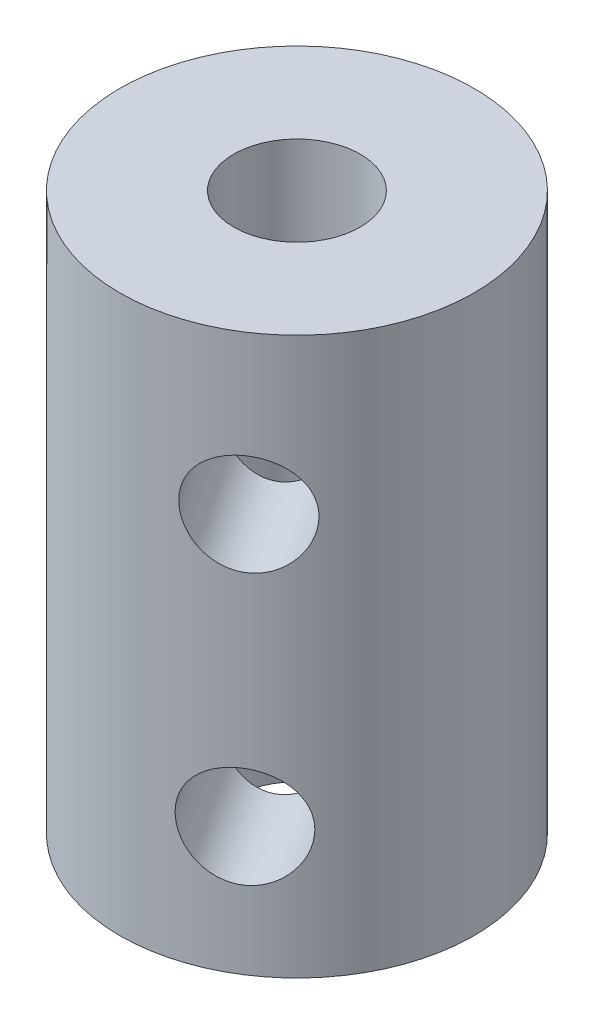
ISO-10303-21;
HEADER;
FILE_DESCRIPTION(('STEP AP214'),'2;1');
FILE_NAME('part.step','',(''),(''),'','','');
FILE_SCHEMA(('AUTOMOTIVE_DESIGN { 1 0 10303 214 1 1 1 1 }'));
ENDSEC;
DATA;
#1=APPLICATION_CONTEXT('core data for automotive mechanical design processes');
#2=APPLICATION_PROTOCOL_DEFINITION('international standard','automotive_design',2000,#1);
#3=PRODUCT_CONTEXT('',#1,'mechanical');
#4=PRODUCT('Part','Part','',(#3));
#5=PRODUCT_RELATED_PRODUCT_CATEGORY('part','',(#4));
#6=PRODUCT_DEFINITION_FORMATION('','',#4);
#7=PRODUCT_DEFINITION_CONTEXT('part definition',#1,'design');
#8=PRODUCT_DEFINITION('design','',#6,#7);
#9=PRODUCT_DEFINITION_SHAPE('','',#8);
#10=(LENGTH_UNIT() NAMED_UNIT(*) SI_UNIT(.MILLI.,.METRE.));
#11=(NAMED_UNIT(*) PLANE_ANGLE_UNIT() SI_UNIT($,.RADIAN.));
#12=(NAMED_UNIT(*) SI_UNIT($,.STERADIAN.) SOLID_ANGLE_UNIT());
#13=UNCERTAINTY_MEASURE_WITH_UNIT(LENGTH_MEASURE(1.E-05),#10,'distance_accuracy_value','');
#14=(GEOMETRIC_REPRESENTATION_CONTEXT(3) GLOBAL_UNCERTAINTY_ASSIGNED_CONTEXT((#13)) GLOBAL_UNIT_ASSIGNED_CONTEXT((#10,
#11,#12)) REPRESENTATION_CONTEXT('',''));
#15=CARTESIAN_POINT('',(0.,0.,0.));
#16=DIRECTION('',(0.,0.,1.));
#17=DIRECTION('',(1.,0.,0.));
#18=AXIS2_PLACEMENT_3D('',#15,#16,#17);
#19=CARTESIAN_POINT('',(0.,22.,0.));
#20=DIRECTION('',(0.,1.,0.));
#21=DIRECTION('',(0.,0.,1.));
#22=AXIS2_PLACEMENT_3D('',#19,#20,#21);
#23=PLANE('',#22);
#24=CARTESIAN_POINT('',(0.,22.,0.));
#25=DIRECTION('',(0.,1.,0.));
#26=DIRECTION('',(0.,0.,1.));
#27=AXIS2_PLACEMENT_3D('',#24,#25,#26);
#28=CIRCLE('',#27,7.);
#29=CARTESIAN_POINT('',(0.,22.,7.));
#30=VERTEX_POINT('',#29);
#31=EDGE_CURVE('E10',#30,#30,#28,.T.);
#32=ORIENTED_EDGE('',*,*,#31,.T.);
#33=EDGE_LOOP('',(#32));
#34=FACE_BOUND('',#33,.T.);
#35=CARTESIAN_POINT('',(0.,22.,0.));
#36=DIRECTION('',(0.,1.,0.));
#37=DIRECTION('',(0.,0.,1.));
#38=AXIS2_PLACEMENT_3D('',#35,#36,#37);
#39=CIRCLE('',#38,2.5);
#40=CARTESIAN_POINT('',(0.,22.,2.5));
#41=VERTEX_POINT('',#40);
#42=EDGE_CURVE('E51',#41,#41,#39,.T.);
#43=ORIENTED_EDGE('',*,*,#42,.F.);
#44=EDGE_LOOP('',(#43));
#45=FACE_BOUND('',#44,.T.);
#46=ADVANCED_FACE('F37',(#34,#45),#23,.T.);
#47=CARTESIAN_POINT('',(0.,0.,0.));
#48=DIRECTION('',(0.,1.,0.));
#49=DIRECTION('',(0.,0.,1.));
#50=AXIS2_PLACEMENT_3D('',#47,#48,#49);
#51=PLANE('',#50);
#52=CARTESIAN_POINT('',(0.,0.,0.));
#53=DIRECTION('',(0.,1.,0.));
#54=DIRECTION('',(0.,0.,1.));
#55=AXIS2_PLACEMENT_3D('',#52,#53,#54);
#56=CIRCLE('',#55,7.);
#57=CARTESIAN_POINT('',(0.,0.,7.));
#58=VERTEX_POINT('',#57);
#59=EDGE_CURVE('E42',#58,#58,#56,.T.);
#60=ORIENTED_EDGE('',*,*,#59,.F.);
#61=EDGE_LOOP('',(#60));
#62=FACE_BOUND('',#61,.T.);
#63=CARTESIAN_POINT('',(0.,0.,0.));
#64=DIRECTION('',(0.,1.,0.));
#65=DIRECTION('',(0.,0.,1.));
#66=AXIS2_PLACEMENT_3D('',#63,#64,#65);
#67=CIRCLE('',#66,2.5);
#68=CARTESIAN_POINT('',(0.,0.,2.5));
#69=VERTEX_POINT('',#68);
#70=EDGE_CURVE('E53',#69,#69,#67,.T.);
#71=ORIENTED_EDGE('',*,*,#70,.T.);
#72=EDGE_LOOP('',(#71));
#73=FACE_BOUND('',#72,.T.);
#74=ADVANCED_FACE('F90',(#62,#73),#51,.F.);
#75=CARTESIAN_POINT('',(0.,22.,0.));
#76=DIRECTION('',(0.,-1.,0.));
#77=DIRECTION('',(0.,0.,-1.));
#78=AXIS2_PLACEMENT_3D('',#75,#76,#77);
#79=CYLINDRICAL_SURFACE('',#78,7.);
#80=CARTESIAN_POINT('',(5.36581565787323,15.771125488098,4.49533339427928));
#81=CARTESIAN_POINT('',(5.36581485346514,15.6612739502207,4.49533576824166));
#82=CARTESIAN_POINT('',(5.35974123733756,15.5514024038435,4.50261441660148));
#83=CARTESIAN_POINT('',(5.33553214663473,15.334854249235,4.53127329762195));
#84=CARTESIAN_POINT('',(5.317391765895,15.2281789589974,4.55265926607672));
#85=CARTESIAN_POINT('',(5.26933370250691,15.0211882872265,4.60819461847386));
#86=CARTESIAN_POINT('',(5.2394342551474,14.9208633362808,4.64232423616661));
#87=CARTESIAN_POINT('',(5.1682148625014,14.7289576765436,4.72148053771039));
#88=CARTESIAN_POINT('',(5.12689356122535,14.6373780077199,4.76650851532336));
#89=CARTESIAN_POINT('',(5.03205861521706,14.4629339227831,4.86654360659417));
#90=CARTESIAN_POINT('',(4.97825614511046,14.3803576859688,4.92177955456895));
#91=CARTESIAN_POINT('',(4.85972973764384,14.2288227047942,5.03884461109025));
#92=CARTESIAN_POINT('',(4.79500452307735,14.1598655549751,5.10067449035964));
#93=CARTESIAN_POINT('',(4.65423612169772,14.0362968397445,5.22946847972574));
#94=CARTESIAN_POINT('',(4.57800486050234,13.981975868347,5.29650668071971));
#95=CARTESIAN_POINT('',(4.41657991777345,13.891123713682,5.43184103346445));
#96=CARTESIAN_POINT('',(4.33138798509686,13.8545890668577,5.5001369376104));
#97=CARTESIAN_POINT('',(4.15638313771624,13.8012910268583,5.63349454555417));
#98=CARTESIAN_POINT('',(4.06674887710075,13.7840364663933,5.69859413765884));
#99=CARTESIAN_POINT('',(3.88334550460181,13.7682387542147,5.82512051195387));
#100=CARTESIAN_POINT('',(3.78957718652299,13.7696920257606,5.88654799395685));
#101=CARTESIAN_POINT('',(3.6035036527534,13.790931863016,6.00220153431371));
#102=CARTESIAN_POINT('',(3.51123453024662,13.810187100736,6.0565844648513));
#103=CARTESIAN_POINT('',(3.32828780261372,13.8656205905624,6.15901761856886));
#104=CARTESIAN_POINT('',(3.23761029467281,13.9017998723601,6.20706745620327));
#105=CARTESIAN_POINT('',(3.05967125417019,13.9904348889098,6.29670183470932));
#106=CARTESIAN_POINT('',(2.97245791288108,14.0430642659063,6.33820993915378));
#107=CARTESIAN_POINT('',(2.80524231648686,14.162970074496,6.41397340592892));
#108=CARTESIAN_POINT('',(2.72524164702042,14.2302497157645,6.44822717568368));
#109=CARTESIAN_POINT('',(2.57239866074912,14.3803311987166,6.51074716187912));
#110=CARTESIAN_POINT('',(2.49990609426721,14.463594921703,6.53876105985734));
#111=CARTESIAN_POINT('',(2.36809224204342,14.6418405799439,6.58764713894158));
#112=CARTESIAN_POINT('',(2.30877202502465,14.736823465047,6.60851874064007));
#113=CARTESIAN_POINT('',(2.20532807630879,14.936856372596,6.64376033442886));
#114=CARTESIAN_POINT('',(2.1613294484365,15.0419807131496,6.65807708986399));
#115=CARTESIAN_POINT('',(2.09128879293356,15.2586786516026,6.68041001054598));
#116=CARTESIAN_POINT('',(2.06524154060625,15.3702503627579,6.68842800912317));
#117=CARTESIAN_POINT('',(2.03301131105211,15.5926059124303,6.69829391081247));
#118=CARTESIAN_POINT('',(2.02618237647406,15.703287305031,6.7003425405813));
#119=CARTESIAN_POINT('',(2.03088784467052,15.9242138040189,6.69891793231375));
#120=CARTESIAN_POINT('',(2.04241995679252,16.0344589631089,6.69544538307818));
#121=CARTESIAN_POINT('',(2.08277755905248,16.2487667161209,6.68299795825269));
#122=CARTESIAN_POINT('',(2.11120103057225,16.3529130741131,6.67415089195218));
#123=CARTESIAN_POINT('',(2.18369841667075,16.5549273600957,6.65078208161375));
#124=CARTESIAN_POINT('',(2.22777458950361,16.6527943797436,6.63625951872744));
#125=CARTESIAN_POINT('',(2.33102721398212,16.8421475633147,6.60070868940883));
#126=CARTESIAN_POINT('',(2.39055030499775,16.9334159323002,6.57952834450397));
#127=CARTESIAN_POINT('',(2.52184852535203,17.1046018615413,6.53032816611004));
#128=CARTESIAN_POINT('',(2.59362630978982,17.1845169551101,6.50230684989082));
#129=CARTESIAN_POINT('',(2.74953992520606,17.3335049063862,6.43796291163561));
#130=CARTESIAN_POINT('',(2.83401124315999,17.4021204595167,6.40139190008547));
#131=CARTESIAN_POINT('',(3.01043480886203,17.5231711694807,6.32033952093111));
#132=CARTESIAN_POINT('',(3.10238666528429,17.5756071720203,6.27585856697176));
#133=CARTESIAN_POINT('',(3.28989919462062,17.6623097751243,6.17960940206046));
#134=CARTESIAN_POINT('',(3.3854264231606,17.6967138776841,6.12790026480284));
#135=CARTESIAN_POINT('',(3.57751800325093,17.7467522900381,6.01777406496875));
#136=CARTESIAN_POINT('',(3.67408208155251,17.7623914282793,5.95935873221619));
#137=CARTESIAN_POINT('',(3.86171659456903,17.7741169220958,5.83944432541048));
#138=CARTESIAN_POINT('',(3.95286093517911,17.7708696371808,5.77812519603147));
#139=CARTESIAN_POINT('',(4.13054937282386,17.7464872066877,5.65246874272907));
#140=CARTESIAN_POINT('',(4.21709368994216,17.7253529177159,5.58813156347908));
#141=CARTESIAN_POINT('',(4.38265592998835,17.6661941271191,5.45923496213073));
#142=CARTESIAN_POINT('',(4.46173422057246,17.628322309154,5.39468266862688));
#143=CARTESIAN_POINT('',(4.61163298005158,17.5368993298125,5.26711866361708));
#144=CARTESIAN_POINT('',(4.6824521681194,17.4833457410057,5.20410719225718));
#145=CARTESIAN_POINT('',(4.81665233869854,17.3602281506732,5.08020227423513));
#146=CARTESIAN_POINT('',(4.87974950387672,17.2902354013096,5.01942753303148));
#147=CARTESIAN_POINT('',(4.99512718312425,17.137016362644,4.90462458413782));
#148=CARTESIAN_POINT('',(5.04740469942223,17.0537864170131,4.85059824784993));
#149=CARTESIAN_POINT('',(5.1417514712833,16.8738285711025,4.7505006619728));
#150=CARTESIAN_POINT('',(5.18351651107405,16.7768035405945,4.70467564960025));
#151=CARTESIAN_POINT('',(5.25448065554834,16.5736036227833,4.62528765012357));
#152=CARTESIAN_POINT('',(5.28368679377003,16.4674338970096,4.5917178011833));
#153=CARTESIAN_POINT('',(5.32615047711215,16.2634717878653,4.54235988643024));
#154=CARTESIAN_POINT('',(5.34100920413319,16.1664351399955,4.52480429014471));
#155=CARTESIAN_POINT('',(5.36084137855093,15.9699793697461,4.50129088479865));
#156=CARTESIAN_POINT('',(5.36581638600531,15.8705606258669,4.495331245422));
#157=CARTESIAN_POINT('',(5.36581565787323,15.771125488098,4.49533339427928));
#158=B_SPLINE_CURVE_WITH_KNOTS('',3,(#80,#81,#82,#83,#84,#85,#86,#87,#88,#89,#90,#91,#92,#93,
#94,#95,#96,#97,#98,#99,#100,#101,#102,#103,#104,#105,#106,#107,#108,#109,#110,#111,#112,#113,
#114,#115,#116,#117,#118,#119,#120,#121,#122,#123,#124,#125,#126,#127,#128,#129,#130,#131,#132,
#133,#134,#135,#136,#137,#138,#139,#140,#141,#142,#143,#144,#145,#146,#147,#148,#149,#150,#151,
#152,#153,#154,#155,#156,#157),.UNSPECIFIED.,.T.,.F.,(4,2,2,2,2,2,2,2,2,2,2,2,2,2,2,2,2,2,2,2,2,
2,2,2,2,2,2,2,2,2,2,2,2,2,2,2,2,2,4),(0.,0.329188342363949,0.658510609618858,0.987324183736434,
1.31617681100734,1.65357167206615,1.99100601238482,2.33471483013845,2.67835669017705,
3.01302901028741,3.34763734552417,3.6725703764342,3.9975231794652,4.32602903378489,
4.65460693184833,4.99471612692998,5.33485290629758,5.67770520630004,6.0204576779301,
6.35154363333478,6.68258828698447,7.00605289656509,7.32956419216038,7.66108006042379,
7.99266784620102,8.33545388376653,8.67822200084644,9.01833685298086,9.35836417076635,
9.68646897684057,10.0145580709057,10.3397141238921,10.6649205354322,10.9997976874537,
11.3347674991531,11.678536124213,12.0221119721565,12.3201328886649,12.61810676147),.UNSPECIFIED.);
#159=CARTESIAN_POINT('',(5.36581565787323,15.771125488098,4.49533339427928));
#160=VERTEX_POINT('',#159);
#161=EDGE_CURVE('E107',#160,#160,#158,.T.);
#162=ORIENTED_EDGE('',*,*,#161,.T.);
#163=EDGE_LOOP('',(#162));
#164=FACE_BOUND('',#163,.T.);
#165=CARTESIAN_POINT('',(5.29047878545062,5.06705350218182,4.58375765291937));
#166=CARTESIAN_POINT('',(5.29047794175848,4.95720196430458,4.58376001320608));
#167=CARTESIAN_POINT('',(5.28428437611465,4.84733041792731,4.59093687041706));
#168=CARTESIAN_POINT('',(5.25960303793053,4.63078226331885,4.61919006633264));
#169=CARTESIAN_POINT('',(5.24111026471844,4.5241069730812,4.640272058626));
#170=CARTESIAN_POINT('',(5.19213723505423,4.31711630131032,4.69500226224334));
#171=CARTESIAN_POINT('',(5.16167553939187,4.21679135036468,4.7286310126458));
#172=CARTESIAN_POINT('',(5.0891523908923,4.02488569062745,4.8065945611455));
#173=CARTESIAN_POINT('',(5.04708956078287,3.93330602180379,4.8509306303245));
#174=CARTESIAN_POINT('',(4.95060763677345,3.75886193686699,4.9493782042377));
#175=CARTESIAN_POINT('',(4.89589595986901,3.67628570005261,5.00371371885336));
#176=CARTESIAN_POINT('',(4.77544323219122,3.52475071887803,5.11879576402226));
#177=CARTESIAN_POINT('',(4.70970089159747,3.45579356905898,5.17954304399759));
#178=CARTESIAN_POINT('',(4.5668145964192,3.33222485382831,5.30598331121513));
#179=CARTESIAN_POINT('',(4.48948136384546,3.27790388243085,5.37174725814384));
#180=CARTESIAN_POINT('',(4.32583283735692,3.18705172776586,5.50438420226572));
#181=CARTESIAN_POINT('',(4.23951929616711,3.15051708094156,5.57125698090965));
#182=CARTESIAN_POINT('',(4.06232553814253,3.09721904094211,5.70169210010814));
#183=CARTESIAN_POINT('',(3.97162332205666,3.07996448047715,5.76529528843541));
#184=CARTESIAN_POINT('',(3.7861455565853,3.06416676829859,5.88876074494848));
#185=CARTESIAN_POINT('',(3.69137078928206,3.06562003984447,5.94862372602336));
#186=CARTESIAN_POINT('',(3.50340365993377,3.08685987709985,6.06117353566845));
#187=CARTESIAN_POINT('',(3.41024478288047,3.10611511481981,6.11401781377114));
#188=CARTESIAN_POINT('',(3.22562341539182,3.1615486046462,6.2134009451302));
#189=CARTESIAN_POINT('',(3.13416102852625,3.19772788644395,6.25993941450685));
#190=CARTESIAN_POINT('',(2.95475904844638,3.28636290299364,6.34660863331365));
#191=CARTESIAN_POINT('',(2.86686890829641,3.33899227999016,6.386663756554));
#192=CARTESIAN_POINT('',(2.69841907716596,3.45889808857985,6.4596419242988));
#193=CARTESIAN_POINT('',(2.6178609980339,3.5261777298483,6.49256340275958));
#194=CARTESIAN_POINT('',(2.46400156744769,3.67625921280041,6.55253842044106));
#195=CARTESIAN_POINT('',(2.39105410526594,3.75952293578687,6.57934547989022));
#196=CARTESIAN_POINT('',(2.25844716150247,3.93776859402778,6.62603743671381));
#197=CARTESIAN_POINT('',(2.19878875811169,4.03275147913083,6.64592177249545));
#198=CARTESIAN_POINT('',(2.09477423535549,4.23278438667981,6.67944190845141));
#199=CARTESIAN_POINT('',(2.05054408602621,4.33790872723348,6.69302655534202));
#200=CARTESIAN_POINT('',(1.98014247042263,4.55460666568644,6.7141941081027));
#201=CARTESIAN_POINT('',(1.95396574974784,4.66617837684173,6.72177876034919));
#202=CARTESIAN_POINT('',(1.92157623812696,4.88853392651413,6.73110845756916));
#203=CARTESIAN_POINT('',(1.91471424781006,4.99921531911484,6.73304348219219));
#204=CARTESIAN_POINT('',(1.91944270879247,5.22014181810278,6.73169715518818));
#205=CARTESIAN_POINT('',(1.93103085832436,5.33038697719274,6.72841645425477));
#206=CARTESIAN_POINT('',(1.97158946271853,5.54469473020477,6.7166404594112));
#207=CARTESIAN_POINT('',(2.00015583338335,5.64884108819698,6.7082662858758));
#208=CARTESIAN_POINT('',(2.07303103140928,5.85085537417955,6.68610375442223));
#209=CARTESIAN_POINT('',(2.11734213030196,5.94872239382746,6.67231461524311));
#210=CARTESIAN_POINT('',(2.22117048678839,6.13807557739856,6.63848211140037));
#211=CARTESIAN_POINT('',(2.28103685969305,6.22934394638401,6.61829244152732));
#212=CARTESIAN_POINT('',(2.41313345492363,6.40052987562517,6.5712778719697));
#213=CARTESIAN_POINT('',(2.48536635658829,6.48044496919395,6.54445153381933));
#214=CARTESIAN_POINT('',(2.64232626114887,6.62943292047,6.48270377092312));
#215=CARTESIAN_POINT('',(2.72739282673467,6.69804847360054,6.44753955811931));
#216=CARTESIAN_POINT('',(2.9051371263319,6.81909918356454,6.36942600831973));
#217=CARTESIAN_POINT('',(2.99781446220714,6.87153518610419,6.326477078418));
#218=CARTESIAN_POINT('',(3.18689838222221,6.95823778920814,6.23335285173147));
#219=CARTESIAN_POINT('',(3.28327054629223,6.99264189176797,6.1832360655125));
#220=CARTESIAN_POINT('',(3.47716316959022,7.04268030412199,6.07631270201266));
#221=CARTESIAN_POINT('',(3.57468332690141,7.05831944236313,6.01950784978305));
#222=CARTESIAN_POINT('',(3.76428192768496,7.0700449361796,5.90272366414377));
#223=CARTESIAN_POINT('',(3.856431280776,7.06679765126463,5.84292547706465));
#224=CARTESIAN_POINT('',(4.03618046239179,7.04241522077152,5.72023498502216));
#225=CARTESIAN_POINT('',(4.12378050856907,7.02128093179977,5.65734282836447));
#226=CARTESIAN_POINT('',(4.29145893112817,6.96212214120296,5.53121140572776));
#227=CARTESIAN_POINT('',(4.37159754855787,6.92425032323784,5.46798026913534));
#228=CARTESIAN_POINT('',(4.52359253356633,6.83282734389633,5.34292133103096));
#229=CARTESIAN_POINT('',(4.59544761650917,6.77927375508956,5.28109374837724));
#230=CARTESIAN_POINT('',(4.73168545341827,6.656156164757,5.1594328824924));
#231=CARTESIAN_POINT('',(4.79578245926985,6.58616341539341,5.09971357855509));
#232=CARTESIAN_POINT('',(4.91304935366166,6.43294437672787,4.98684107781676));
#233=CARTESIAN_POINT('',(4.96621621378825,6.34971443109698,4.93368970241351));
#234=CARTESIAN_POINT('',(5.06221106794098,6.16975658518635,4.83517154147233));
#235=CARTESIAN_POINT('',(5.10473080189075,6.07273155467833,4.79004591092264));
#236=CARTESIAN_POINT('',(5.17700258228742,5.86953163686718,4.7118464606677));
#237=CARTESIAN_POINT('',(5.20676177517298,5.76336191109348,4.67876589678955));
#238=CARTESIAN_POINT('',(5.25003868337379,5.55939980194916,4.63011944400696));
#239=CARTESIAN_POINT('',(5.26518669146989,5.46236315407929,4.61281283889946));
#240=CARTESIAN_POINT('',(5.2854063292458,5.2659073838299,4.58963177720432));
#241=CARTESIAN_POINT('',(5.29047954914175,5.16648863995072,4.58375551644101));
#242=CARTESIAN_POINT('',(5.29047878545062,5.06705350218182,4.58375765291937));
#243=B_SPLINE_CURVE_WITH_KNOTS('',3,(#165,#166,#167,#168,#169,#170,#171,#172,#173,#174,#175,
#176,#177,#178,#179,#180,#181,#182,#183,#184,#185,#186,#187,#188,#189,#190,#191,#192,#193,#194,
#195,#196,#197,#198,#199,#200,#201,#202,#203,#204,#205,#206,#207,#208,#209,#210,#211,#212,#213,
#214,#215,#216,#217,#218,#219,#220,#221,#222,#223,#224,#225,#226,#227,#228,#229,#230,#231,#232,
#233,#234,#235,#236,#237,#238,#239,#240,#241,#242),.UNSPECIFIED.,.T.,.F.,(4,2,2,2,2,2,2,2,2,2,2,
2,2,2,2,2,2,2,2,2,2,2,2,2,2,2,2,2,2,2,2,2,2,2,2,2,2,2,4),(0.,0.329188342363949,
0.658510609618859,0.987324183736435,1.31617681100734,1.65357167206616,1.99100601238482,
2.33471483013845,2.67835669017705,3.01302901028741,3.34763734552417,3.6725703764342,
3.9975231794652,4.3260290337849,4.65460693184833,4.99471612692998,5.33485290629758,
5.67770520630004,6.0204576779301,6.35154363333479,6.68258828698447,7.00605289656509,
7.32956419216039,7.66108006042379,7.99266784620102,8.33545388376654,8.67822200084645,
9.01833685298086,9.35836417076635,9.68646897684057,10.0145580709057,10.3397141238921,
10.6649205354322,10.9997976874537,11.3347674991531,11.678536124213,12.0221119721565,
12.3201328886649,12.61810676147),.UNSPECIFIED.);
#244=CARTESIAN_POINT('',(5.29047878545062,5.06705350218182,4.58375765291937));
#245=VERTEX_POINT('',#244);
#246=EDGE_CURVE('E57',#245,#245,#243,.T.);
#247=ORIENTED_EDGE('',*,*,#246,.T.);
#248=EDGE_LOOP('',(#247));
#249=FACE_BOUND('',#248,.T.);
#250=ORIENTED_EDGE('',*,*,#31,.F.);
#251=EDGE_LOOP('',(#250));
#252=FACE_BOUND('',#251,.T.);
#253=ORIENTED_EDGE('',*,*,#59,.T.);
#254=EDGE_LOOP('',(#253));
#255=FACE_BOUND('',#254,.T.);
#256=ADVANCED_FACE('F39',(#164,#249,#252,#255),#79,.T.);
#257=CARTESIAN_POINT('',(0.,22.,0.));
#258=DIRECTION('',(0.,-1.,0.));
#259=DIRECTION('',(0.,0.,-1.));
#260=AXIS2_PLACEMENT_3D('',#257,#258,#259);
#261=CYLINDRICAL_SURFACE('',#260,2.5);
#262=CARTESIAN_POINT('',(2.49552994492394,15.771125488098,0.149433242579863));
#263=CARTESIAN_POINT('',(2.49553410610126,15.6960444707094,0.149457767406845));
#264=CARTESIAN_POINT('',(2.49513271548447,15.6208465620044,0.156593552977705));
#265=CARTESIAN_POINT('',(2.4932526193862,15.4728109586684,0.184011219687482));
#266=CARTESIAN_POINT('',(2.49177021521225,15.3999822662858,0.204338208229382));
#267=CARTESIAN_POINT('',(2.48621880498623,15.2335200685894,0.26437898660974));
#268=CARTESIAN_POINT('',(2.4814283220689,15.1414829809984,0.308380611908809));
#269=CARTESIAN_POINT('',(2.46680885443117,14.9651573479367,0.409218777195173));
#270=CARTESIAN_POINT('',(2.45696560641305,14.8808915384308,0.466091394833475));
#271=CARTESIAN_POINT('',(2.42582221912762,14.6907858313175,0.610424037279154));
#272=CARTESIAN_POINT('',(2.40166675505395,14.5881589139707,0.701509176833182));
#273=CARTESIAN_POINT('',(2.33745846779927,14.3971486528858,0.892445675418994));
#274=CARTESIAN_POINT('',(2.2974188693137,14.3087535459841,0.992289688328138));
#275=CARTESIAN_POINT('',(2.20823325697164,14.1640205685205,1.1755645551909));
#276=CARTESIAN_POINT('',(2.16244624503213,14.1047992054139,1.25834367736081));
#277=CARTESIAN_POINT('',(2.05754520111338,13.9987595281317,1.42338567228424));
#278=CARTESIAN_POINT('',(1.99845214725152,13.9519219398971,1.50564915039877));
#279=CARTESIAN_POINT('',(1.87728082315984,13.8794125275173,1.65330231345201));
#280=CARTESIAN_POINT('',(1.81723011628124,13.8515429235219,1.71926966483056));
#281=CARTESIAN_POINT('',(1.68813202622494,13.807626792844,1.84618069531469));
#282=CARTESIAN_POINT('',(1.6190895876448,13.7915738001879,1.90712710560758));
#283=CARTESIAN_POINT('',(1.47326437346868,13.7722673948078,2.02191184190585));
#284=CARTESIAN_POINT('',(1.39645573591,13.7690582954093,2.07572494077122));
#285=CARTESIAN_POINT('',(1.23768641847112,13.7757897229702,2.17413330518537));
#286=CARTESIAN_POINT('',(1.15572550033245,13.7857308584665,2.2187281440418));
#287=CARTESIAN_POINT('',(0.993987691140919,13.817193474411,2.29555549207005));
#288=CARTESIAN_POINT('',(0.914335211483324,13.8380543050541,2.32832928644896));
#289=CARTESIAN_POINT('',(0.755095971206109,13.8898207223502,2.3847376057385));
#290=CARTESIAN_POINT('',(0.675509232254891,13.9207288435956,2.40836982123958));
#291=CARTESIAN_POINT('',(0.510629256573716,13.9947261866865,2.44890686055867));
#292=CARTESIAN_POINT('',(0.425524837297256,14.0387020041127,2.46494433831679));
#293=CARTESIAN_POINT('',(0.25934917435879,14.1356633476897,2.48792832323184));
#294=CARTESIAN_POINT('',(0.178280221481262,14.1886539174611,2.49486972224286));
#295=CARTESIAN_POINT('',(0.00537875596991419,14.3141873568968,2.50178196322238));
#296=CARTESIAN_POINT('',(-0.0852289222590319,14.3885091023028,2.50002148656258));
#297=CARTESIAN_POINT('',(-0.256544454098029,14.5473813917487,2.48828393199938));
#298=CARTESIAN_POINT('',(-0.337240032128665,14.6319443667723,2.47829678140065));
#299=CARTESIAN_POINT('',(-0.478760292797488,14.8023456839159,2.45467364131601));
#300=CARTESIAN_POINT('',(-0.540750336974108,14.8872764286117,2.44148183319863));
#301=CARTESIAN_POINT('',(-0.651100456817628,15.0654919544325,2.41439004970947));
#302=CARTESIAN_POINT('',(-0.699490275276836,15.1587579084356,2.40049169941787));
#303=CARTESIAN_POINT('',(-0.765764828135936,15.3239170921257,2.38000685572425));
#304=CARTESIAN_POINT('',(-0.788449478691117,15.3937383189959,2.37248040027031));
#305=CARTESIAN_POINT('',(-0.822560003748828,15.5363056940521,2.36087447833071));
#306=CARTESIAN_POINT('',(-0.834010977439323,15.6090449420086,2.35678733038828));
#307=CARTESIAN_POINT('',(-0.844238076989046,15.7559888660254,2.35314687401983));
#308=CARTESIAN_POINT('',(-0.842940743965892,15.8301995731554,2.35361984180913));
#309=CARTESIAN_POINT('',(-0.827684697002795,15.9771728131354,2.35902385443165));
#310=CARTESIAN_POINT('',(-0.813708117548641,16.0499331544854,2.36396118968701));
#311=CARTESIAN_POINT('',(-0.769897806008892,16.2101886907598,2.37863437055548));
#312=CARTESIAN_POINT('',(-0.736934697721673,16.2967237562288,2.38927138252366));
#313=CARTESIAN_POINT('',(-0.657956775589055,16.4634163541835,2.41221565437231));
#314=CARTESIAN_POINT('',(-0.611903091640144,16.5435539690011,2.42452783071996));
#315=CARTESIAN_POINT('',(-0.486557670963192,16.7326544174473,2.45337518616211));
#316=CARTESIAN_POINT('',(-0.401700983442854,16.8380208224231,2.46926368611813));
#317=CARTESIAN_POINT('',(-0.216706421664304,17.03550963734,2.49234617520726));
#318=CARTESIAN_POINT('',(-0.116550605959759,17.1276162477814,2.4995298665975));
#319=CARTESIAN_POINT('',(0.0970558125005419,17.298588295443,2.50043239283175));
#320=CARTESIAN_POINT('',(0.210674358295644,17.377248117211,2.49395942460466));
#321=CARTESIAN_POINT('',(0.446115082323989,17.5163920155422,2.46271569620545));
#322=CARTESIAN_POINT('',(0.567909012965134,17.5769350937686,2.43800526283756));
#323=CARTESIAN_POINT('',(0.774563004428284,17.6596160755649,2.37857562151438));
#324=CARTESIAN_POINT('',(0.858671841874181,17.6878428650721,2.3496512066517));
#325=CARTESIAN_POINT('',(1.02589302975271,17.7325576230619,2.28159217774214));
#326=CARTESIAN_POINT('',(1.10900609308349,17.7490545526386,2.2424653891584));
#327=CARTESIAN_POINT('',(1.27186422615053,17.7693183122027,2.15428984850638));
#328=CARTESIAN_POINT('',(1.35159596828526,17.7730386931563,2.10520557923427));
#329=CARTESIAN_POINT('',(1.50472181629879,17.7673589788327,1.99862783764434));
#330=CARTESIAN_POINT('',(1.57811547553254,17.7579579596897,1.94113377345562));
#331=CARTESIAN_POINT('',(1.71281940208361,17.7275219410068,1.82314175776634));
#332=CARTESIAN_POINT('',(1.77456602278266,17.7071361566951,1.76296899637488));
#333=CARTESIAN_POINT('',(1.88965730767264,17.6562720667845,1.63901092547298));
#334=CARTESIAN_POINT('',(1.94299979051222,17.6257911472719,1.57522468388081));
#335=CARTESIAN_POINT('',(2.04561369841807,17.5527509437054,1.43990713142749));
#336=CARTESIAN_POINT('',(2.0940443800144,17.509331645987,1.36820744490269));
#337=CARTESIAN_POINT('',(2.180997040616,17.4134831510033,1.22486425953375));
#338=CARTESIAN_POINT('',(2.21951373145001,17.3610491700295,1.15322081091456));
#339=CARTESIAN_POINT('',(2.29439549576515,17.2368292750943,0.997332311087561));
#340=CARTESIAN_POINT('',(2.32870653447405,17.1632790747825,0.913509412938761));
#341=CARTESIAN_POINT('',(2.38590603494821,17.0060085625746,0.751551645897652));
#342=CARTESIAN_POINT('',(2.4087801735608,16.9222756604926,0.673424013567315));
#343=CARTESIAN_POINT('',(2.44360000724971,16.7521679435684,0.532579727723158));
#344=CARTESIAN_POINT('',(2.45627925368662,16.6665529668819,0.469127984347531));
#345=CARTESIAN_POINT('',(2.47540805873022,16.4867335998466,0.35455903164313));
#346=CARTESIAN_POINT('',(2.48186931892837,16.3925457100602,0.303418789971656));
#347=CARTESIAN_POINT('',(2.48935532593267,16.2249861613453,0.23236843118363));
#348=CARTESIAN_POINT('',(2.49142320225937,16.1537059436908,0.207694882061746));
#349=CARTESIAN_POINT('',(2.49424551205522,16.0081012171271,0.170600397192609));
#350=CARTESIAN_POINT('',(2.49500495267482,15.93378943282,0.158132830812877));
#351=CARTESIAN_POINT('',(2.49546473460345,15.8298002737556,0.150500480681478));
#352=CARTESIAN_POINT('',(2.49552831847756,15.8004718098545,0.149423656755261));
#353=CARTESIAN_POINT('',(2.49552994492394,15.771125488098,0.149433242579863));
#354=B_SPLINE_CURVE_WITH_KNOTS('',3,(#262,#263,#264,#265,#266,#267,#268,#269,#270,#271,#272,
#273,#274,#275,#276,#277,#278,#279,#280,#281,#282,#283,#284,#285,#286,#287,#288,#289,#290,#291,
#292,#293,#294,#295,#296,#297,#298,#299,#300,#301,#302,#303,#304,#305,#306,#307,#308,#309,#310,
#311,#312,#313,#314,#315,#316,#317,#318,#319,#320,#321,#322,#323,#324,#325,#326,#327,#328,#329,
#330,#331,#332,#333,#334,#335,#336,#337,#338,#339,#340,#341,#342,#343,#344,#345,#346,#347,#348,
#349,#350,#351,#352,#353),.UNSPECIFIED.,.T.,.F.,(4,2,2,2,2,2,2,2,2,2,2,2,2,2,2,2,2,2,2,2,2,2,2,
2,2,2,2,2,2,2,2,2,2,2,2,2,2,2,2,2,2,2,2,2,2,4),(0.,0.22514081881329,0.451055593895017,
0.75571438466088,1.06123795594964,1.47720804611674,1.8928325353688,2.22639303179097,
2.55943127851024,2.83862094435177,3.11765772560939,3.39765639927927,3.67766803055208,
3.94241917501296,4.20723715914624,4.49756510688427,4.78805602626152,5.13841226546404,
5.48919811771066,5.80619193384966,6.12248701337035,6.34307726284836,6.56317352160415,
6.78453876949453,7.00621641426757,7.28428560377193,7.56318925297412,7.96975811975665,
8.37680748728569,8.78961174948151,9.20105660259842,9.47985927613149,9.7584487272425,
10.0380499218877,10.3176708039936,10.5823344198312,10.8470666181456,11.1364335884202,
11.4259545900794,11.7747351905782,12.1239515037794,12.4449574092071,12.7653580273015,
12.9909138326701,13.2156045429056,13.3036035490356),.UNSPECIFIED.);
#355=CARTESIAN_POINT('',(2.49552994492394,15.771125488098,0.149433242579863));
#356=VERTEX_POINT('',#355);
#357=EDGE_CURVE('E113',#356,#356,#354,.T.);
#358=ORIENTED_EDGE('',*,*,#357,.F.);
#359=EDGE_LOOP('',(#358));
#360=FACE_BOUND('',#359,.T.);
#361=CARTESIAN_POINT('',(2.4927065367136,5.06705350218182,0.190824845932808));
#362=CARTESIAN_POINT('',(2.49271029033963,4.99197248479326,0.190849436435585));
#363=CARTESIAN_POINT('',(2.49219053989005,4.9167745760882,0.197977578522463));
#364=CARTESIAN_POINT('',(2.48985571901695,4.7687389727522,0.2253602705128));
#365=CARTESIAN_POINT('',(2.4880362018735,4.69591028036969,0.245659860229889));
#366=CARTESIAN_POINT('',(2.48148920676393,4.52944808267327,0.305600247941782));
#367=CARTESIAN_POINT('',(2.47596919660719,4.43741099508227,0.349516318387695));
#368=CARTESIAN_POINT('',(2.45967837873716,4.26108536202053,0.450097994976706));
#369=CARTESIAN_POINT('',(2.44889271099805,4.17681955251468,0.506799437110044));
#370=CARTESIAN_POINT('',(2.4153584778143,3.98671384540131,0.650595394813103));
#371=CARTESIAN_POINT('',(2.38969482361419,3.88408692805454,0.741267143143485));
#372=CARTESIAN_POINT('',(2.32232687374557,3.6930766669696,0.93111184276633));
#373=CARTESIAN_POINT('',(2.28063592285703,3.60468156006792,1.03027766840549));
#374=CARTESIAN_POINT('',(2.18842122853232,3.45994858260435,1.21204730399678));
#375=CARTESIAN_POINT('',(2.1412668396736,3.40072721949775,1.29405521301129));
#376=CARTESIAN_POINT('',(2.03364144395607,3.29468754221552,1.45733369689754));
#377=CARTESIAN_POINT('',(1.97319140228026,3.24784995398095,1.53860522516921));
#378=CARTESIAN_POINT('',(1.84958652651609,3.17534054160117,1.68422727373701));
#379=CARTESIAN_POINT('',(1.78844939047483,3.14747093760571,1.74918902741709));
#380=CARTESIAN_POINT('',(1.65726304647367,3.10355480692783,1.8739402585226));
#381=CARTESIAN_POINT('',(1.58721873710768,3.08750181427178,1.9337325488126));
#382=CARTESIAN_POINT('',(1.43950880260957,3.06819540889169,2.04608157652151));
#383=CARTESIAN_POINT('',(1.36181773770878,3.06498630949318,2.09861266110671));
#384=CARTESIAN_POINT('',(1.20143724075201,3.07171773705401,2.19437277045591));
#385=CARTESIAN_POINT('',(1.11874757755111,3.08165887255037,2.23760136463253));
#386=CARTESIAN_POINT('',(0.955757124714291,3.11312148849487,2.311734168513));
#387=CARTESIAN_POINT('',(0.875571746961422,3.1339823191379,2.34318165343985));
#388=CARTESIAN_POINT('',(0.715418363448681,3.18574873643406,2.3969397028702));
#389=CARTESIAN_POINT('',(0.635450417677826,3.21665685767939,2.41924795864174));
#390=CARTESIAN_POINT('',(0.469920452129656,3.29065420077034,2.45704330813085));
#391=CARTESIAN_POINT('',(0.384561617017773,3.33463001819653,2.47166630856059));
#392=CARTESIAN_POINT('',(0.218027427551362,3.43159136177353,2.49188951934373));
#393=CARTESIAN_POINT('',(0.136854448433222,3.48458193154491,2.49748466026913));
#394=CARTESIAN_POINT('',(-0.0361379142169845,3.61011537098067,2.50152672855532));
#395=CARTESIAN_POINT('',(-0.126703901560313,3.68443711638669,2.49826290125627));
#396=CARTESIAN_POINT('',(-0.297801064076702,3.84330940583257,2.48368405990164));
#397=CARTESIAN_POINT('',(-0.3783197982089,3.9278723808561,2.47235917824537));
#398=CARTESIAN_POINT('',(-0.519428556466098,4.09827369799975,2.44639082692416));
#399=CARTESIAN_POINT('',(-0.581191152647536,4.18320444269553,2.43217213882176));
#400=CARTESIAN_POINT('',(-0.691076501620311,4.36141996851635,2.40325287598131));
#401=CARTESIAN_POINT('',(-0.739229020075868,4.45468592251946,2.38855343253163));
#402=CARTESIAN_POINT('',(-0.805154510371692,4.61984510620958,2.36697161363051));
#403=CARTESIAN_POINT('',(-0.827711139182864,4.68966633307972,2.35906975314162));
#404=CARTESIAN_POINT('',(-0.861624372282095,4.83223370813597,2.34689938073409));
#405=CARTESIAN_POINT('',(-0.873005944831721,4.90497295609248,2.34262277190684));
#406=CARTESIAN_POINT('',(-0.88317122440946,5.05191688010919,2.33881310277725));
#407=CARTESIAN_POINT('',(-0.881881918712196,5.12612758723927,2.33930753408865));
#408=CARTESIAN_POINT('',(-0.866717649612614,5.27310082721924,2.34496396971897));
#409=CARTESIAN_POINT('',(-0.85282492754283,5.34586116856928,2.35013256006391));
#410=CARTESIAN_POINT('',(-0.809264143373279,5.50611670484364,2.36553073257049));
#411=CARTESIAN_POINT('',(-0.776482090427853,5.59265177031266,2.37671328756698));
#412=CARTESIAN_POINT('',(-0.697895793186128,5.75934436826729,2.40096500257614));
#413=CARTESIAN_POINT('',(-0.652052765725217,5.83948198308492,2.41403972341063));
#414=CARTESIAN_POINT('',(-0.527203313670783,6.02858243153112,2.44496315663522));
#415=CARTESIAN_POINT('',(-0.442621973227586,6.13394883650698,2.46225762675167));
#416=CARTESIAN_POINT('',(-0.258035928368391,6.33143765142383,2.48840683770397));
#417=CARTESIAN_POINT('',(-0.158013114090239,6.42354426186528,2.49725157994504));
#418=CARTESIAN_POINT('',(0.0555489139867576,6.59451630952686,2.50169868289875));
#419=CARTESIAN_POINT('',(0.169259230583773,6.67317613129489,2.49711205388943));
#420=CARTESIAN_POINT('',(0.405186010088456,6.81232002962601,2.46977965904699));
#421=CARTESIAN_POINT('',(0.527373228197914,6.87286310785245,2.44709374295526));
#422=CARTESIAN_POINT('',(0.734984971396522,6.9555440896487,2.39110161367366));
#423=CARTESIAN_POINT('',(0.819562214606343,6.98377087915592,2.36357692943067));
#424=CARTESIAN_POINT('',(0.987889784822085,7.02848563714579,2.29830223144683));
#425=CARTESIAN_POINT('',(1.07164069476801,7.04498256672243,2.26056005392177));
#426=CARTESIAN_POINT('',(1.23593963528874,7.06524632628651,2.17509921131462));
#427=CARTESIAN_POINT('',(1.316474929489,7.06896670724012,2.12734481275392));
#428=CARTESIAN_POINT('',(1.47134830120471,7.06328699291659,2.02332280034463));
#429=CARTESIAN_POINT('',(1.54568594195844,7.05388597377352,1.96705458729477));
#430=CARTESIAN_POINT('',(1.68232934355804,7.02344995509059,1.85131416914282));
#431=CARTESIAN_POINT('',(1.74506600131884,7.00306417077897,1.79217435045667));
#432=CARTESIAN_POINT('',(1.86219846585942,6.95220008086834,1.67014323577686));
#433=CARTESIAN_POINT('',(1.91659210705569,6.92171916135579,1.60725097163129));
#434=CARTESIAN_POINT('',(2.02143741814383,6.84867895778925,1.47365488321363));
#435=CARTESIAN_POINT('',(2.0710512544525,6.80525966007081,1.40276875470898));
#436=CARTESIAN_POINT('',(2.16037065648745,6.70941116508718,1.2608882472475));
#437=CARTESIAN_POINT('',(2.20007093393722,6.65697718411331,1.18989383075391));
#438=CARTESIAN_POINT('',(2.27752928560116,6.53275728917812,1.03526942529745));
#439=CARTESIAN_POINT('',(2.3132266024442,6.45920708886639,0.952027445494256));
#440=CARTESIAN_POINT('',(2.37310584181436,6.30193657665841,0.791041179459272));
#441=CARTESIAN_POINT('',(2.39727332307366,6.21820367457646,0.713303891106809));
#442=CARTESIAN_POINT('',(2.43442560873294,6.04809595765221,0.573056818611999));
#443=CARTESIAN_POINT('',(2.44815606196497,5.96248098096573,0.509824218778863));
#444=CARTESIAN_POINT('',(2.46918345245865,5.78266161393044,0.395588475881968));
#445=CARTESIAN_POINT('',(2.47649247191169,5.68847372414407,0.344562497829607));
#446=CARTESIAN_POINT('',(2.48515649636831,5.52091417542914,0.273646149467675));
#447=CARTESIAN_POINT('',(2.48763353423411,5.44963395777462,0.249010313330374));
#448=CARTESIAN_POINT('',(2.49107102144257,5.30402923121095,0.211967771274218));
#449=CARTESIAN_POINT('',(2.49203725106026,5.22971744690386,0.199514524235248));
#450=CARTESIAN_POINT('',(2.49262362504344,5.12572828783948,0.191890854941395));
#451=CARTESIAN_POINT('',(2.49270506956357,5.09639982393835,0.190815234438029));
#452=CARTESIAN_POINT('',(2.4927065367136,5.06705350218182,0.190824845932808));
#453=B_SPLINE_CURVE_WITH_KNOTS('',3,(#361,#362,#363,#364,#365,#366,#367,#368,#369,#370,#371,
#372,#373,#374,#375,#376,#377,#378,#379,#380,#381,#382,#383,#384,#385,#386,#387,#388,#389,#390,
#391,#392,#393,#394,#395,#396,#397,#398,#399,#400,#401,#402,#403,#404,#405,#406,#407,#408,#409,
#410,#411,#412,#413,#414,#415,#416,#417,#418,#419,#420,#421,#422,#423,#424,#425,#426,#427,#428,
#429,#430,#431,#432,#433,#434,#435,#436,#437,#438,#439,#440,#441,#442,#443,#444,#445,#446,#447,
#448,#449,#450,#451,#452),.UNSPECIFIED.,.T.,.F.,(4,2,2,2,2,2,2,2,2,2,2,2,2,2,2,2,2,2,2,2,2,2,2,
2,2,2,2,2,2,2,2,2,2,2,2,2,2,2,2,2,2,2,2,2,2,4),(0.,0.225140818813289,0.451055593895016,
0.755714384660879,1.06123795594964,1.47720804611673,1.89283253536879,2.22639303179097,
2.55943127851024,2.83862094435177,3.11765772560938,3.39765639927927,3.67766803055208,
3.94241917501296,4.20723715914624,4.49756510688427,4.78805602626151,5.13841226546403,
5.48919811771066,5.80619193384965,6.12248701337035,6.34307726284835,6.56317352160415,
6.78453876949453,7.00621641426756,7.28428560377193,7.56318925297412,7.96975811975665,
8.37680748728569,8.78961174948151,9.20105660259842,9.47985927613149,9.7584487272425,
10.0380499218877,10.3176708039936,10.5823344198312,10.8470666181456,11.1364335884202,
11.4259545900794,11.7747351905782,12.1239515037794,12.4449574092071,12.7653580273015,
12.9909138326701,13.2156045429056,13.3036035490356),.UNSPECIFIED.);
#454=CARTESIAN_POINT('',(2.4927065367136,5.06705350218182,0.190824845932808));
#455=VERTEX_POINT('',#454);
#456=EDGE_CURVE('E68',#455,#455,#453,.T.);
#457=ORIENTED_EDGE('',*,*,#456,.F.);
#458=EDGE_LOOP('',(#457));
#459=FACE_BOUND('',#458,.T.);
#460=ORIENTED_EDGE('',*,*,#42,.T.);
#461=EDGE_LOOP('',(#460));
#462=FACE_BOUND('',#461,.T.);
#463=ORIENTED_EDGE('',*,*,#70,.F.);
#464=EDGE_LOOP('',(#463));
#465=FACE_BOUND('',#464,.T.);
#466=ADVANCED_FACE('F79',(#360,#459,#462,#465),#261,.F.);
#467=CARTESIAN_POINT('',(3.76029932678938,5.06705350218182,5.90424838340558));
#468=DIRECTION('',(0.537185618112768,0.,0.843464054772225));
#469=DIRECTION('',(0.843464054772225,0.,-0.537185618112768));
#470=AXIS2_PLACEMENT_3D('',#467,#468,#469);
#471=CYLINDRICAL_SURFACE('',#470,1.99999999999999);
#472=ORIENTED_EDGE('',*,*,#456,.T.);
#473=EDGE_LOOP('',(#472));
#474=FACE_BOUND('',#473,.T.);
#475=ORIENTED_EDGE('',*,*,#246,.F.);
#476=EDGE_LOOP('',(#475));
#477=FACE_BOUND('',#476,.T.);
#478=ADVANCED_FACE('F74',(#474,#477),#471,.F.);
#479=CARTESIAN_POINT('',(3.85775984409334,15.771125488098,5.84103492416378));
#480=DIRECTION('',(0.551108549156191,0.,0.834433560594825));
#481=DIRECTION('',(0.834433560594825,0.,-0.551108549156191));
#482=AXIS2_PLACEMENT_3D('',#479,#480,#481);
#483=CYLINDRICAL_SURFACE('',#482,1.99999999999999);
#484=ORIENTED_EDGE('',*,*,#357,.T.);
#485=EDGE_LOOP('',(#484));
#486=FACE_BOUND('',#485,.T.);
#487=ORIENTED_EDGE('',*,*,#161,.F.);
#488=EDGE_LOOP('',(#487));
#489=FACE_BOUND('',#488,.T.);
#490=ADVANCED_FACE('F78',(#486,#489),#483,.F.);
#491=CLOSED_SHELL('',(#46,#74,#256,#466,#478,#490));
#492=MANIFOLD_SOLID_BREP('B2',#491);
#493=ADVANCED_BREP_SHAPE_REPRESENTATION('',(#18,#492),#14);
#494=SHAPE_DEFINITION_REPRESENTATION(#9,#493);
ENDSEC;
END-ISO-10303-21;
